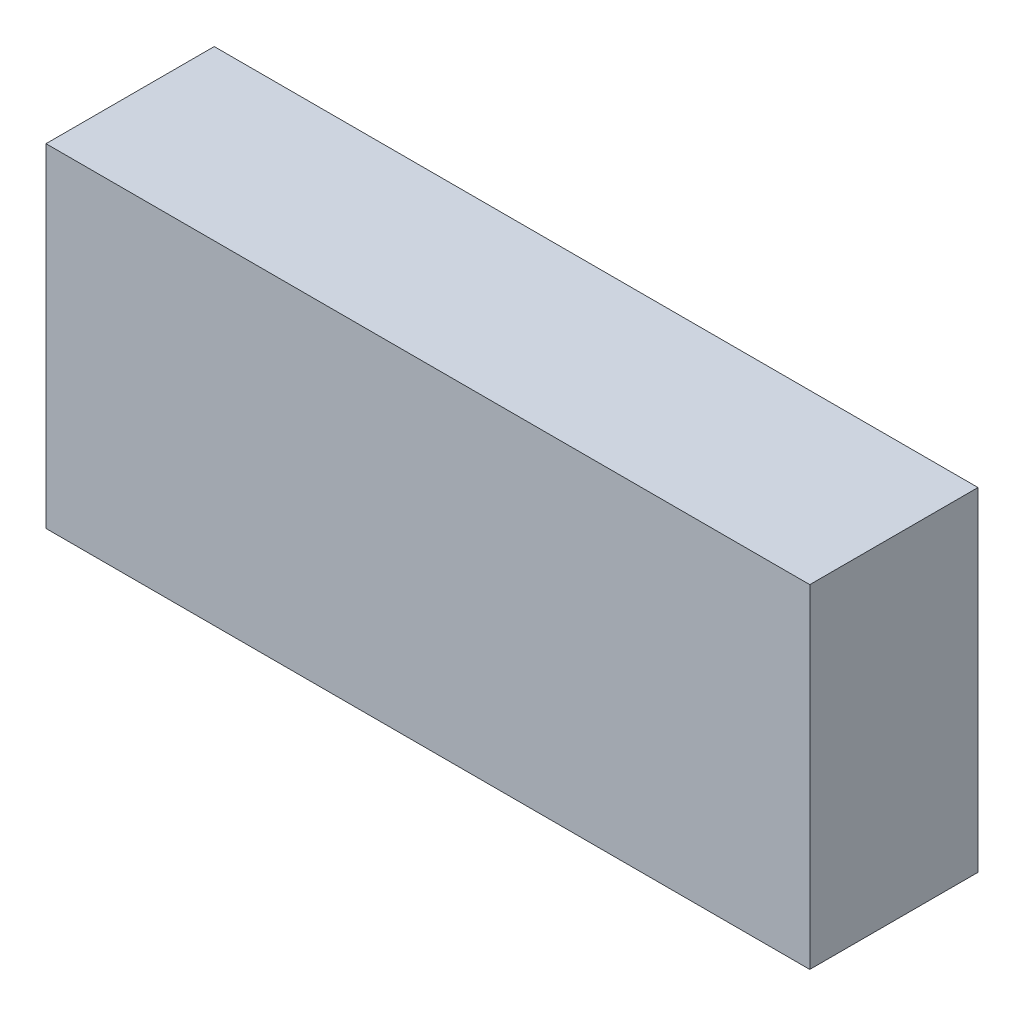
ISO-10303-21;
HEADER;
FILE_DESCRIPTION(('STEP AP214'),'2;1');
FILE_NAME('part.step','',(''),(''),'','','');
FILE_SCHEMA(('AUTOMOTIVE_DESIGN { 1 0 10303 214 1 1 1 1 }'));
ENDSEC;
DATA;
#1=APPLICATION_CONTEXT('core data for automotive mechanical design processes');
#2=APPLICATION_PROTOCOL_DEFINITION('international standard','automotive_design',2000,#1);
#3=PRODUCT_CONTEXT('',#1,'mechanical');
#4=PRODUCT('Part','Part','',(#3));
#5=PRODUCT_RELATED_PRODUCT_CATEGORY('part','',(#4));
#6=PRODUCT_DEFINITION_FORMATION('','',#4);
#7=PRODUCT_DEFINITION_CONTEXT('part definition',#1,'design');
#8=PRODUCT_DEFINITION('design','',#6,#7);
#9=PRODUCT_DEFINITION_SHAPE('','',#8);
#10=(LENGTH_UNIT() NAMED_UNIT(*) SI_UNIT(.MILLI.,.METRE.));
#11=(NAMED_UNIT(*) PLANE_ANGLE_UNIT() SI_UNIT($,.RADIAN.));
#12=(NAMED_UNIT(*) SI_UNIT($,.STERADIAN.) SOLID_ANGLE_UNIT());
#13=UNCERTAINTY_MEASURE_WITH_UNIT(LENGTH_MEASURE(1.E-05),#10,'distance_accuracy_value','');
#14=(GEOMETRIC_REPRESENTATION_CONTEXT(3) GLOBAL_UNCERTAINTY_ASSIGNED_CONTEXT((#13)) GLOBAL_UNIT_ASSIGNED_CONTEXT((#10,
#11,#12)) REPRESENTATION_CONTEXT('',''));
#15=CARTESIAN_POINT('',(0.,0.,0.));
#16=DIRECTION('',(0.,0.,1.));
#17=DIRECTION('',(1.,0.,0.));
#18=AXIS2_PLACEMENT_3D('',#15,#16,#17);
#19=CARTESIAN_POINT('',(-0.57659778,0.2515997,0.));
#20=DIRECTION('',(1.,0.,0.));
#21=DIRECTION('',(0.,-1.,0.));
#22=AXIS2_PLACEMENT_3D('',#19,#20,#21);
#23=PLANE('',#22);
#24=DIRECTION('',(0.,-1.,0.));
#25=VECTOR('',#24,1.);
#26=CARTESIAN_POINT('',(-0.57659778,0.2515997,0.));
#27=LINE('',#26,#25);
#28=CARTESIAN_POINT('',(-0.57659778,0.2515997,0.));
#29=VERTEX_POINT('',#28);
#30=CARTESIAN_POINT('',(-0.57659778,-0.2515997,0.));
#31=VERTEX_POINT('',#30);
#32=EDGE_CURVE('E11',#29,#31,#27,.T.);
#33=ORIENTED_EDGE('',*,*,#32,.T.);
#34=DIRECTION('',(0.,0.,1.));
#35=VECTOR('',#34,1.);
#36=CARTESIAN_POINT('',(-0.57659778,-0.2515997,0.));
#37=LINE('',#36,#35);
#38=CARTESIAN_POINT('',(-0.57659778,-0.2515997,0.254));
#39=VERTEX_POINT('',#38);
#40=EDGE_CURVE('E24',#31,#39,#37,.T.);
#41=ORIENTED_EDGE('',*,*,#40,.T.);
#42=DIRECTION('',(0.,-1.,0.));
#43=VECTOR('',#42,1.);
#44=CARTESIAN_POINT('',(-0.57659778,0.2515997,0.254));
#45=LINE('',#44,#43);
#46=CARTESIAN_POINT('',(-0.57659778,0.2515997,0.254));
#47=VERTEX_POINT('',#46);
#48=EDGE_CURVE('E87',#47,#39,#45,.T.);
#49=ORIENTED_EDGE('',*,*,#48,.F.);
#50=DIRECTION('',(0.,0.,1.));
#51=VECTOR('',#50,1.);
#52=CARTESIAN_POINT('',(-0.57659778,0.2515997,0.));
#53=LINE('',#52,#51);
#54=EDGE_CURVE('E36',#29,#47,#53,.T.);
#55=ORIENTED_EDGE('',*,*,#54,.F.);
#56=EDGE_LOOP('',(#33,#41,#49,#55));
#57=FACE_BOUND('',#56,.T.);
#58=ADVANCED_FACE('F17',(#57),#23,.F.);
#59=CARTESIAN_POINT('',(-0.57659778,-0.2515997,0.));
#60=DIRECTION('',(0.,1.,0.));
#61=DIRECTION('',(1.,0.,0.));
#62=AXIS2_PLACEMENT_3D('',#59,#60,#61);
#63=PLANE('',#62);
#64=DIRECTION('',(1.,0.,0.));
#65=VECTOR('',#64,1.);
#66=CARTESIAN_POINT('',(-0.57659778,-0.2515997,0.));
#67=LINE('',#66,#65);
#68=CARTESIAN_POINT('',(0.57659778,-0.2515997,0.));
#69=VERTEX_POINT('',#68);
#70=EDGE_CURVE('E84',#31,#69,#67,.T.);
#71=ORIENTED_EDGE('',*,*,#70,.T.);
#72=DIRECTION('',(0.,0.,1.));
#73=VECTOR('',#72,1.);
#74=CARTESIAN_POINT('',(0.57659778,-0.2515997,0.));
#75=LINE('',#74,#73);
#76=CARTESIAN_POINT('',(0.57659778,-0.2515997,0.254));
#77=VERTEX_POINT('',#76);
#78=EDGE_CURVE('E82',#69,#77,#75,.T.);
#79=ORIENTED_EDGE('',*,*,#78,.T.);
#80=DIRECTION('',(1.,0.,0.));
#81=VECTOR('',#80,1.);
#82=CARTESIAN_POINT('',(-0.57659778,-0.2515997,0.254));
#83=LINE('',#82,#81);
#84=EDGE_CURVE('E62',#39,#77,#83,.T.);
#85=ORIENTED_EDGE('',*,*,#84,.F.);
#86=ORIENTED_EDGE('',*,*,#40,.F.);
#87=EDGE_LOOP('',(#71,#79,#85,#86));
#88=FACE_BOUND('',#87,.T.);
#89=ADVANCED_FACE('F89',(#88),#63,.F.);
#90=CARTESIAN_POINT('',(0.57659778,-0.2515997,0.));
#91=DIRECTION('',(-1.,0.,0.));
#92=DIRECTION('',(0.,1.,0.));
#93=AXIS2_PLACEMENT_3D('',#90,#91,#92);
#94=PLANE('',#93);
#95=DIRECTION('',(0.,1.,0.));
#96=VECTOR('',#95,1.);
#97=CARTESIAN_POINT('',(0.57659778,-0.2515997,0.));
#98=LINE('',#97,#96);
#99=CARTESIAN_POINT('',(0.57659778,0.2515997,0.));
#100=VERTEX_POINT('',#99);
#101=EDGE_CURVE('E71',#69,#100,#98,.T.);
#102=ORIENTED_EDGE('',*,*,#101,.T.);
#103=DIRECTION('',(0.,0.,1.));
#104=VECTOR('',#103,1.);
#105=CARTESIAN_POINT('',(0.57659778,0.2515997,0.));
#106=LINE('',#105,#104);
#107=CARTESIAN_POINT('',(0.57659778,0.2515997,0.254));
#108=VERTEX_POINT('',#107);
#109=EDGE_CURVE('E65',#100,#108,#106,.T.);
#110=ORIENTED_EDGE('',*,*,#109,.T.);
#111=DIRECTION('',(0.,1.,0.));
#112=VECTOR('',#111,1.);
#113=CARTESIAN_POINT('',(0.57659778,-0.2515997,0.254));
#114=LINE('',#113,#112);
#115=EDGE_CURVE('E57',#77,#108,#114,.T.);
#116=ORIENTED_EDGE('',*,*,#115,.F.);
#117=ORIENTED_EDGE('',*,*,#78,.F.);
#118=EDGE_LOOP('',(#102,#110,#116,#117));
#119=FACE_BOUND('',#118,.T.);
#120=ADVANCED_FACE('F69',(#119),#94,.F.);
#121=CARTESIAN_POINT('',(0.57659778,0.2515997,0.));
#122=DIRECTION('',(0.,-1.,0.));
#123=DIRECTION('',(-1.,0.,0.));
#124=AXIS2_PLACEMENT_3D('',#121,#122,#123);
#125=PLANE('',#124);
#126=DIRECTION('',(-1.,0.,0.));
#127=VECTOR('',#126,1.);
#128=CARTESIAN_POINT('',(0.57659778,0.2515997,0.));
#129=LINE('',#128,#127);
#130=EDGE_CURVE('E66',#100,#29,#129,.T.);
#131=ORIENTED_EDGE('',*,*,#130,.T.);
#132=ORIENTED_EDGE('',*,*,#54,.T.);
#133=DIRECTION('',(-1.,0.,0.));
#134=VECTOR('',#133,1.);
#135=CARTESIAN_POINT('',(0.57659778,0.2515997,0.254));
#136=LINE('',#135,#134);
#137=EDGE_CURVE('E61',#108,#47,#136,.T.);
#138=ORIENTED_EDGE('',*,*,#137,.F.);
#139=ORIENTED_EDGE('',*,*,#109,.F.);
#140=EDGE_LOOP('',(#131,#132,#138,#139));
#141=FACE_BOUND('',#140,.T.);
#142=ADVANCED_FACE('F76',(#141),#125,.F.);
#143=CARTESIAN_POINT('',(-0.57659778,0.2515997,0.));
#144=DIRECTION('',(0.,0.,-1.));
#145=DIRECTION('',(-1.,0.,0.));
#146=AXIS2_PLACEMENT_3D('',#143,#144,#145);
#147=PLANE('',#146);
#148=ORIENTED_EDGE('',*,*,#130,.F.);
#149=ORIENTED_EDGE('',*,*,#101,.F.);
#150=ORIENTED_EDGE('',*,*,#70,.F.);
#151=ORIENTED_EDGE('',*,*,#32,.F.);
#152=EDGE_LOOP('',(#148,#149,#150,#151));
#153=FACE_BOUND('',#152,.T.);
#154=ADVANCED_FACE('F91',(#153),#147,.T.);
#155=CARTESIAN_POINT('',(-0.57659778,0.2515997,0.254));
#156=DIRECTION('',(0.,0.,-1.));
#157=DIRECTION('',(-1.,0.,0.));
#158=AXIS2_PLACEMENT_3D('',#155,#156,#157);
#159=PLANE('',#158);
#160=ORIENTED_EDGE('',*,*,#48,.T.);
#161=ORIENTED_EDGE('',*,*,#84,.T.);
#162=ORIENTED_EDGE('',*,*,#115,.T.);
#163=ORIENTED_EDGE('',*,*,#137,.T.);
#164=EDGE_LOOP('',(#160,#161,#162,#163));
#165=FACE_BOUND('',#164,.T.);
#166=ADVANCED_FACE('F59',(#165),#159,.F.);
#167=CLOSED_SHELL('',(#58,#89,#120,#142,#154,#166));
#168=MANIFOLD_SOLID_BREP('B1',#167);
#169=ADVANCED_BREP_SHAPE_REPRESENTATION('',(#18,#168),#14);
#170=SHAPE_DEFINITION_REPRESENTATION(#9,#169);
ENDSEC;
END-ISO-10303-21;
